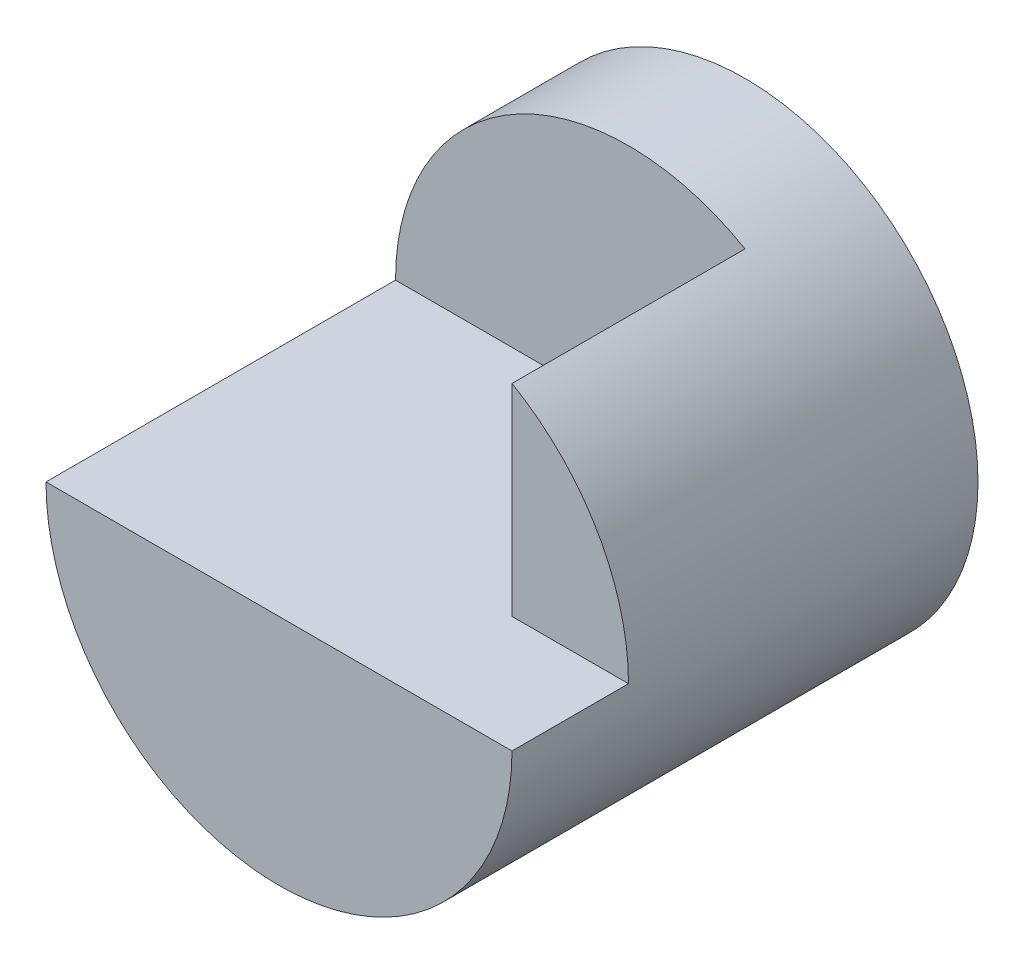
ISO-10303-21;
HEADER;
FILE_DESCRIPTION(('STEP AP214'),'2;1');
FILE_NAME('part.step','',(''),(''),'','','');
FILE_SCHEMA(('AUTOMOTIVE_DESIGN { 1 0 10303 214 1 1 1 1 }'));
ENDSEC;
DATA;
#1=APPLICATION_CONTEXT('core data for automotive mechanical design processes');
#2=APPLICATION_PROTOCOL_DEFINITION('international standard','automotive_design',2000,#1);
#3=PRODUCT_CONTEXT('',#1,'mechanical');
#4=PRODUCT('Part','Part','',(#3));
#5=PRODUCT_RELATED_PRODUCT_CATEGORY('part','',(#4));
#6=PRODUCT_DEFINITION_FORMATION('','',#4);
#7=PRODUCT_DEFINITION_CONTEXT('part definition',#1,'design');
#8=PRODUCT_DEFINITION('design','',#6,#7);
#9=PRODUCT_DEFINITION_SHAPE('','',#8);
#10=(LENGTH_UNIT() NAMED_UNIT(*) SI_UNIT(.MILLI.,.METRE.));
#11=(NAMED_UNIT(*) PLANE_ANGLE_UNIT() SI_UNIT($,.RADIAN.));
#12=(NAMED_UNIT(*) SI_UNIT($,.STERADIAN.) SOLID_ANGLE_UNIT());
#13=UNCERTAINTY_MEASURE_WITH_UNIT(LENGTH_MEASURE(1.E-05),#10,'distance_accuracy_value','');
#14=(GEOMETRIC_REPRESENTATION_CONTEXT(3) GLOBAL_UNCERTAINTY_ASSIGNED_CONTEXT((#13)) GLOBAL_UNIT_ASSIGNED_CONTEXT((#10,
#11,#12)) REPRESENTATION_CONTEXT('',''));
#15=CARTESIAN_POINT('',(0.,0.,0.));
#16=DIRECTION('',(0.,0.,1.));
#17=DIRECTION('',(1.,0.,0.));
#18=AXIS2_PLACEMENT_3D('',#15,#16,#17);
#19=CARTESIAN_POINT('',(0.,0.,40.));
#20=DIRECTION('',(0.,0.,-1.));
#21=DIRECTION('',(-1.,0.,0.));
#22=AXIS2_PLACEMENT_3D('',#19,#20,#21);
#23=CYLINDRICAL_SURFACE('',#22,20.);
#24=CARTESIAN_POINT('',(0.,0.,0.));
#25=DIRECTION('',(0.,0.,1.));
#26=DIRECTION('',(1.,0.,0.));
#27=AXIS2_PLACEMENT_3D('',#24,#25,#26);
#28=CIRCLE('',#27,20.);
#29=CARTESIAN_POINT('',(20.,0.,0.));
#30=VERTEX_POINT('',#29);
#31=EDGE_CURVE('E99',#30,#30,#28,.T.);
#32=ORIENTED_EDGE('',*,*,#31,.T.);
#33=EDGE_LOOP('',(#32));
#34=FACE_BOUND('',#33,.T.);
#35=CARTESIAN_POINT('',(0.,0.,10.));
#36=DIRECTION('',(0.,0.,-1.));
#37=DIRECTION('',(-1.,0.,0.));
#38=AXIS2_PLACEMENT_3D('',#35,#36,#37);
#39=CIRCLE('',#38,20.);
#40=CARTESIAN_POINT('',(-20.,0.,10.));
#41=VERTEX_POINT('',#40);
#42=CARTESIAN_POINT('',(10.,17.3205080756888,10.));
#43=VERTEX_POINT('',#42);
#44=EDGE_CURVE('E40',#41,#43,#39,.T.);
#45=ORIENTED_EDGE('',*,*,#44,.T.);
#46=DIRECTION('',(0.,0.,-1.));
#47=VECTOR('',#46,1.);
#48=CARTESIAN_POINT('',(10.,17.3205080756888,40.));
#49=LINE('',#48,#47);
#50=CARTESIAN_POINT('',(10.,17.3205080756888,30.));
#51=VERTEX_POINT('',#50);
#52=EDGE_CURVE('E90',#43,#51,#49,.F.);
#53=ORIENTED_EDGE('',*,*,#52,.T.);
#54=CARTESIAN_POINT('',(0.,0.,30.));
#55=DIRECTION('',(0.,0.,1.));
#56=DIRECTION('',(0.,-1.,0.));
#57=AXIS2_PLACEMENT_3D('',#54,#55,#56);
#58=CIRCLE('',#57,20.);
#59=CARTESIAN_POINT('',(20.,0.,30.));
#60=VERTEX_POINT('',#59);
#61=EDGE_CURVE('E87',#60,#51,#58,.T.);
#62=ORIENTED_EDGE('',*,*,#61,.F.);
#63=DIRECTION('',(0.,0.,-1.));
#64=VECTOR('',#63,1.);
#65=CARTESIAN_POINT('',(20.,0.,40.));
#66=LINE('',#65,#64);
#67=CARTESIAN_POINT('',(20.,0.,40.));
#68=VERTEX_POINT('',#67);
#69=EDGE_CURVE('E89',#68,#60,#66,.T.);
#70=ORIENTED_EDGE('',*,*,#69,.F.);
#71=CARTESIAN_POINT('',(0.,0.,40.));
#72=DIRECTION('',(0.,0.,1.));
#73=DIRECTION('',(1.,0.,0.));
#74=AXIS2_PLACEMENT_3D('',#71,#72,#73);
#75=CIRCLE('',#74,20.);
#76=CARTESIAN_POINT('',(-20.,0.,40.));
#77=VERTEX_POINT('',#76);
#78=EDGE_CURVE('E100',#77,#68,#75,.T.);
#79=ORIENTED_EDGE('',*,*,#78,.F.);
#80=DIRECTION('',(0.,0.,-1.));
#81=VECTOR('',#80,1.);
#82=CARTESIAN_POINT('',(-20.,0.,40.));
#83=LINE('',#82,#81);
#84=EDGE_CURVE('E47',#41,#77,#83,.F.);
#85=ORIENTED_EDGE('',*,*,#84,.F.);
#86=EDGE_LOOP('',(#45,#53,#62,#70,#79,#85));
#87=FACE_BOUND('',#86,.T.);
#88=ADVANCED_FACE('F33',(#34,#87),#23,.T.);
#89=CARTESIAN_POINT('',(0.,0.,40.));
#90=DIRECTION('',(0.,0.,1.));
#91=DIRECTION('',(1.,0.,0.));
#92=AXIS2_PLACEMENT_3D('',#89,#90,#91);
#93=PLANE('',#92);
#94=ORIENTED_EDGE('',*,*,#78,.T.);
#95=DIRECTION('',(-1.,0.,0.));
#96=VECTOR('',#95,1.);
#97=CARTESIAN_POINT('',(40.,0.,40.));
#98=LINE('',#97,#96);
#99=EDGE_CURVE('E51',#68,#77,#98,.T.);
#100=ORIENTED_EDGE('',*,*,#99,.T.);
#101=EDGE_LOOP('',(#94,#100));
#102=FACE_BOUND('',#101,.T.);
#103=ADVANCED_FACE('F117',(#102),#93,.T.);
#104=CARTESIAN_POINT('',(0.,0.,0.));
#105=DIRECTION('',(0.,0.,1.));
#106=DIRECTION('',(1.,0.,0.));
#107=AXIS2_PLACEMENT_3D('',#104,#105,#106);
#108=PLANE('',#107);
#109=ORIENTED_EDGE('',*,*,#31,.F.);
#110=EDGE_LOOP('',(#109));
#111=FACE_BOUND('',#110,.T.);
#112=ADVANCED_FACE('F110',(#111),#108,.F.);
#113=CARTESIAN_POINT('',(-40.,20.,10.));
#114=DIRECTION('',(0.,0.,-1.));
#115=DIRECTION('',(-1.,0.,0.));
#116=AXIS2_PLACEMENT_3D('',#113,#114,#115);
#117=PLANE('',#116);
#118=ORIENTED_EDGE('',*,*,#44,.F.);
#119=DIRECTION('',(1.,0.,0.));
#120=VECTOR('',#119,1.);
#121=CARTESIAN_POINT('',(0.,0.,10.));
#122=LINE('',#121,#120);
#123=CARTESIAN_POINT('',(10.,0.,10.));
#124=VERTEX_POINT('',#123);
#125=EDGE_CURVE('E79',#41,#124,#122,.T.);
#126=ORIENTED_EDGE('',*,*,#125,.T.);
#127=DIRECTION('',(0.,-1.,0.));
#128=VECTOR('',#127,1.);
#129=CARTESIAN_POINT('',(10.,40.,10.));
#130=LINE('',#129,#128);
#131=EDGE_CURVE('E76',#43,#124,#130,.T.);
#132=ORIENTED_EDGE('',*,*,#131,.F.);
#133=EDGE_LOOP('',(#118,#126,#132));
#134=FACE_BOUND('',#133,.T.);
#135=ADVANCED_FACE('F107',(#134),#117,.F.);
#136=CARTESIAN_POINT('',(40.,0.,40.));
#137=DIRECTION('',(0.,1.,0.));
#138=DIRECTION('',(0.,0.,1.));
#139=AXIS2_PLACEMENT_3D('',#136,#137,#138);
#140=PLANE('',#139);
#141=ORIENTED_EDGE('',*,*,#69,.T.);
#142=DIRECTION('',(-1.,0.,0.));
#143=VECTOR('',#142,1.);
#144=CARTESIAN_POINT('',(40.,0.,30.));
#145=LINE('',#144,#143);
#146=CARTESIAN_POINT('',(10.,0.,30.));
#147=VERTEX_POINT('',#146);
#148=EDGE_CURVE('E85',#60,#147,#145,.T.);
#149=ORIENTED_EDGE('',*,*,#148,.T.);
#150=DIRECTION('',(0.,0.,1.));
#151=VECTOR('',#150,1.);
#152=CARTESIAN_POINT('',(10.,0.,0.));
#153=LINE('',#152,#151);
#154=EDGE_CURVE('E70',#124,#147,#153,.T.);
#155=ORIENTED_EDGE('',*,*,#154,.F.);
#156=ORIENTED_EDGE('',*,*,#125,.F.);
#157=ORIENTED_EDGE('',*,*,#84,.T.);
#158=ORIENTED_EDGE('',*,*,#99,.F.);
#159=EDGE_LOOP('',(#141,#149,#155,#156,#157,#158));
#160=FACE_BOUND('',#159,.T.);
#161=ADVANCED_FACE('F88',(#160),#140,.T.);
#162=CARTESIAN_POINT('',(40.,20.,30.));
#163=DIRECTION('',(0.,0.,1.));
#164=DIRECTION('',(0.,-1.,0.));
#165=AXIS2_PLACEMENT_3D('',#162,#163,#164);
#166=PLANE('',#165);
#167=DIRECTION('',(0.,1.,0.));
#168=VECTOR('',#167,1.);
#169=CARTESIAN_POINT('',(10.,20.,30.));
#170=LINE('',#169,#168);
#171=EDGE_CURVE('E11',#147,#51,#170,.T.);
#172=ORIENTED_EDGE('',*,*,#171,.F.);
#173=ORIENTED_EDGE('',*,*,#148,.F.);
#174=ORIENTED_EDGE('',*,*,#61,.T.);
#175=EDGE_LOOP('',(#172,#173,#174));
#176=FACE_BOUND('',#175,.T.);
#177=ADVANCED_FACE('F84',(#176),#166,.T.);
#178=CARTESIAN_POINT('',(10.,40.,0.));
#179=DIRECTION('',(1.,0.,0.));
#180=DIRECTION('',(0.,0.,-1.));
#181=AXIS2_PLACEMENT_3D('',#178,#179,#180);
#182=PLANE('',#181);
#183=ORIENTED_EDGE('',*,*,#131,.T.);
#184=ORIENTED_EDGE('',*,*,#154,.T.);
#185=ORIENTED_EDGE('',*,*,#171,.T.);
#186=ORIENTED_EDGE('',*,*,#52,.F.);
#187=EDGE_LOOP('',(#183,#184,#185,#186));
#188=FACE_BOUND('',#187,.T.);
#189=ADVANCED_FACE('F72',(#188),#182,.F.);
#190=CLOSED_SHELL('',(#88,#103,#112,#135,#161,#177,#189));
#191=MANIFOLD_SOLID_BREP('B2',#190);
#192=ADVANCED_BREP_SHAPE_REPRESENTATION('',(#18,#191),#14);
#193=SHAPE_DEFINITION_REPRESENTATION(#9,#192);
ENDSEC;
END-ISO-10303-21;
